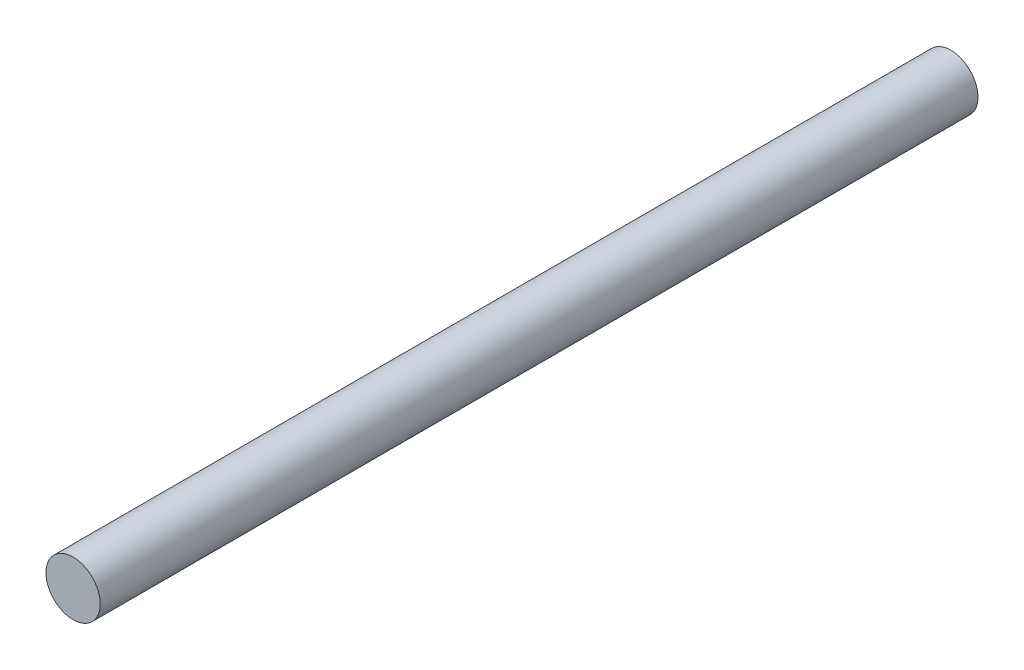
ISO-10303-21;
HEADER;
FILE_DESCRIPTION(('STEP AP214'),'2;1');
FILE_NAME('part.step','',(''),(''),'','','');
FILE_SCHEMA(('AUTOMOTIVE_DESIGN { 1 0 10303 214 1 1 1 1 }'));
ENDSEC;
DATA;
#1=APPLICATION_CONTEXT('core data for automotive mechanical design processes');
#2=APPLICATION_PROTOCOL_DEFINITION('international standard','automotive_design',2000,#1);
#3=PRODUCT_CONTEXT('',#1,'mechanical');
#4=PRODUCT('Part','Part','',(#3));
#5=PRODUCT_RELATED_PRODUCT_CATEGORY('part','',(#4));
#6=PRODUCT_DEFINITION_FORMATION('','',#4);
#7=PRODUCT_DEFINITION_CONTEXT('part definition',#1,'design');
#8=PRODUCT_DEFINITION('design','',#6,#7);
#9=PRODUCT_DEFINITION_SHAPE('','',#8);
#10=(LENGTH_UNIT() NAMED_UNIT(*) SI_UNIT(.MILLI.,.METRE.));
#11=(NAMED_UNIT(*) PLANE_ANGLE_UNIT() SI_UNIT($,.RADIAN.));
#12=(NAMED_UNIT(*) SI_UNIT($,.STERADIAN.) SOLID_ANGLE_UNIT());
#13=UNCERTAINTY_MEASURE_WITH_UNIT(LENGTH_MEASURE(1.E-05),#10,'distance_accuracy_value','');
#14=(GEOMETRIC_REPRESENTATION_CONTEXT(3) GLOBAL_UNCERTAINTY_ASSIGNED_CONTEXT((#13)) GLOBAL_UNIT_ASSIGNED_CONTEXT((#10,
#11,#12)) REPRESENTATION_CONTEXT('',''));
#15=CARTESIAN_POINT('',(0.,0.,0.));
#16=DIRECTION('',(0.,0.,1.));
#17=DIRECTION('',(1.,0.,0.));
#18=AXIS2_PLACEMENT_3D('',#15,#16,#17);
#19=CARTESIAN_POINT('',(0.,0.,97.));
#20=DIRECTION('',(0.,0.,-1.));
#21=DIRECTION('',(-1.,0.,0.));
#22=AXIS2_PLACEMENT_3D('',#19,#20,#21);
#23=CYLINDRICAL_SURFACE('',#22,3.);
#24=CARTESIAN_POINT('',(0.,0.,97.));
#25=DIRECTION('',(0.,0.,1.));
#26=DIRECTION('',(1.,0.,0.));
#27=AXIS2_PLACEMENT_3D('',#24,#25,#26);
#28=CIRCLE('',#27,3.);
#29=CARTESIAN_POINT('',(3.,0.,97.));
#30=VERTEX_POINT('',#29);
#31=EDGE_CURVE('E10',#30,#30,#28,.T.);
#32=ORIENTED_EDGE('',*,*,#31,.F.);
#33=EDGE_LOOP('',(#32));
#34=FACE_BOUND('',#33,.T.);
#35=CARTESIAN_POINT('',(0.,0.,0.));
#36=DIRECTION('',(0.,0.,1.));
#37=DIRECTION('',(1.,0.,0.));
#38=AXIS2_PLACEMENT_3D('',#35,#36,#37);
#39=CIRCLE('',#38,3.);
#40=CARTESIAN_POINT('',(3.,0.,0.));
#41=VERTEX_POINT('',#40);
#42=EDGE_CURVE('E35',#41,#41,#39,.T.);
#43=ORIENTED_EDGE('',*,*,#42,.T.);
#44=EDGE_LOOP('',(#43));
#45=FACE_BOUND('',#44,.T.);
#46=ADVANCED_FACE('F32',(#34,#45),#23,.T.);
#47=CARTESIAN_POINT('',(0.,0.,97.));
#48=DIRECTION('',(0.,0.,1.));
#49=DIRECTION('',(1.,0.,0.));
#50=AXIS2_PLACEMENT_3D('',#47,#48,#49);
#51=PLANE('',#50);
#52=ORIENTED_EDGE('',*,*,#31,.T.);
#53=EDGE_LOOP('',(#52));
#54=FACE_BOUND('',#53,.T.);
#55=ADVANCED_FACE('F47',(#54),#51,.T.);
#56=CARTESIAN_POINT('',(0.,0.,0.));
#57=DIRECTION('',(0.,0.,1.));
#58=DIRECTION('',(1.,0.,0.));
#59=AXIS2_PLACEMENT_3D('',#56,#57,#58);
#60=PLANE('',#59);
#61=ORIENTED_EDGE('',*,*,#42,.F.);
#62=EDGE_LOOP('',(#61));
#63=FACE_BOUND('',#62,.T.);
#64=ADVANCED_FACE('F45',(#63),#60,.F.);
#65=CLOSED_SHELL('',(#46,#55,#64));
#66=MANIFOLD_SOLID_BREP('B2',#65);
#67=ADVANCED_BREP_SHAPE_REPRESENTATION('',(#18,#66),#14);
#68=SHAPE_DEFINITION_REPRESENTATION(#9,#67);
ENDSEC;
END-ISO-10303-21;
